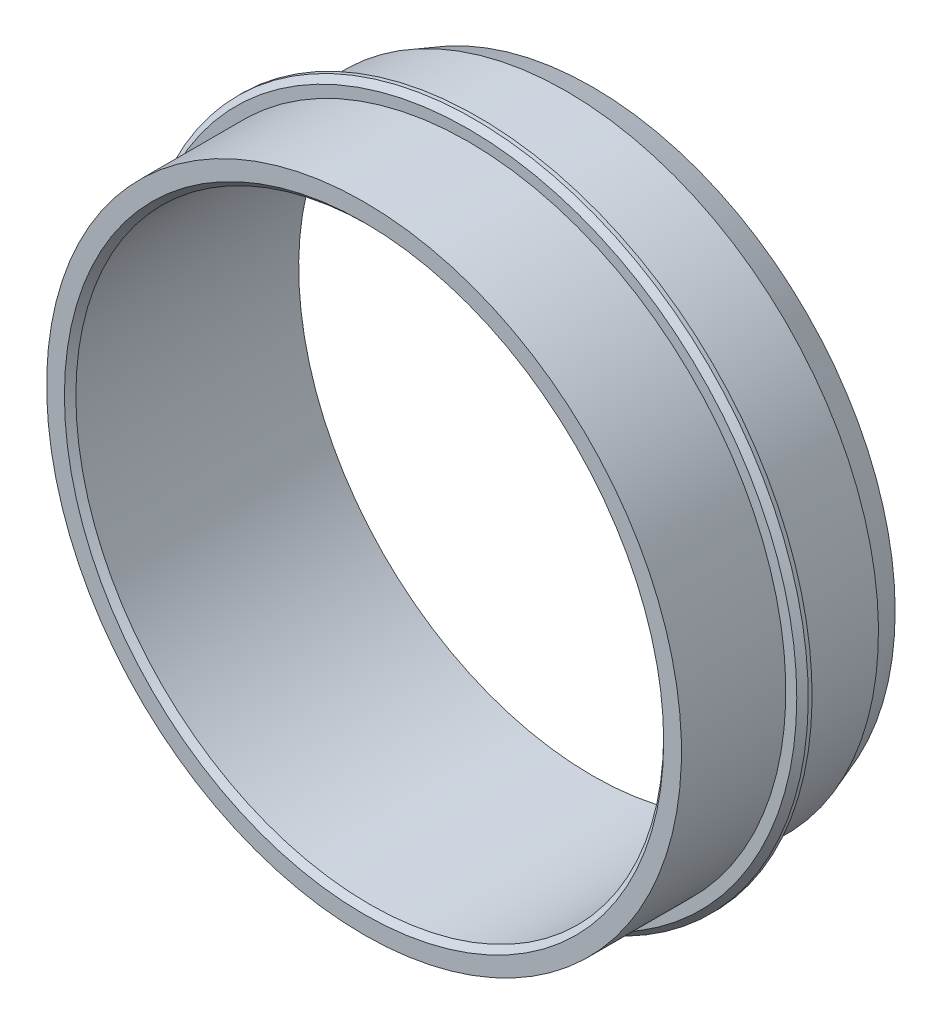
ISO-10303-21;
HEADER;
FILE_DESCRIPTION(('STEP AP214'),'2;1');
FILE_NAME('part.step','',(''),(''),'','','');
FILE_SCHEMA(('AUTOMOTIVE_DESIGN { 1 0 10303 214 1 1 1 1 }'));
ENDSEC;
DATA;
#1=APPLICATION_CONTEXT('core data for automotive mechanical design processes');
#2=APPLICATION_PROTOCOL_DEFINITION('international standard','automotive_design',2000,#1);
#3=PRODUCT_CONTEXT('',#1,'mechanical');
#4=PRODUCT('Part','Part','',(#3));
#5=PRODUCT_RELATED_PRODUCT_CATEGORY('part','',(#4));
#6=PRODUCT_DEFINITION_FORMATION('','',#4);
#7=PRODUCT_DEFINITION_CONTEXT('part definition',#1,'design');
#8=PRODUCT_DEFINITION('design','',#6,#7);
#9=PRODUCT_DEFINITION_SHAPE('','',#8);
#10=(LENGTH_UNIT() NAMED_UNIT(*) SI_UNIT(.MILLI.,.METRE.));
#11=(NAMED_UNIT(*) PLANE_ANGLE_UNIT() SI_UNIT($,.RADIAN.));
#12=(NAMED_UNIT(*) SI_UNIT($,.STERADIAN.) SOLID_ANGLE_UNIT());
#13=UNCERTAINTY_MEASURE_WITH_UNIT(LENGTH_MEASURE(1.E-05),#10,'distance_accuracy_value','');
#14=(GEOMETRIC_REPRESENTATION_CONTEXT(3) GLOBAL_UNCERTAINTY_ASSIGNED_CONTEXT((#13)) GLOBAL_UNIT_ASSIGNED_CONTEXT((#10,
#11,#12)) REPRESENTATION_CONTEXT('',''));
#15=CARTESIAN_POINT('',(0.,0.,0.));
#16=DIRECTION('',(0.,0.,1.));
#17=DIRECTION('',(1.,0.,0.));
#18=AXIS2_PLACEMENT_3D('',#15,#16,#17);
#19=CARTESIAN_POINT('',(-34.98,-24.5,900.55));
#20=DIRECTION('',(0.,0.,1.));
#21=DIRECTION('',(0.,-1.,0.));
#22=AXIS2_PLACEMENT_3D('',#19,#20,#21);
#23=PLANE('',#22);
#24=CARTESIAN_POINT('',(0.,-24.5,900.55));
#25=DIRECTION('',(0.,0.,-1.));
#26=DIRECTION('',(0.,-1.,0.));
#27=AXIS2_PLACEMENT_3D('',#24,#25,#26);
#28=CIRCLE('',#27,33.23);
#29=CARTESIAN_POINT('',(0.,-57.73,900.55));
#30=VERTEX_POINT('',#29);
#31=EDGE_CURVE('E104',#30,#30,#28,.T.);
#32=ORIENTED_EDGE('',*,*,#31,.T.);
#33=EDGE_LOOP('',(#32));
#34=FACE_BOUND('',#33,.T.);
#35=CARTESIAN_POINT('',(0.,-24.5,900.55));
#36=DIRECTION('',(0.,0.,1.));
#37=DIRECTION('',(0.,1.,0.));
#38=AXIS2_PLACEMENT_3D('',#35,#36,#37);
#39=CIRCLE('',#38,34.38);
#40=CARTESIAN_POINT('',(0.,-58.88,900.55));
#41=VERTEX_POINT('',#40);
#42=EDGE_CURVE('E73',#41,#41,#39,.T.);
#43=ORIENTED_EDGE('',*,*,#42,.T.);
#44=EDGE_LOOP('',(#43));
#45=FACE_BOUND('',#44,.T.);
#46=ADVANCED_FACE('F17',(#34,#45),#23,.T.);
#47=CARTESIAN_POINT('',(-32.68,-24.5,899.55));
#48=DIRECTION('',(0.,0.,-1.));
#49=DIRECTION('',(1.,0.,0.));
#50=AXIS2_PLACEMENT_3D('',#47,#48,#49);
#51=PLANE('',#50);
#52=CARTESIAN_POINT('',(0.,-24.5,899.55));
#53=DIRECTION('',(0.,0.,-1.));
#54=DIRECTION('',(0.,-1.,0.));
#55=AXIS2_PLACEMENT_3D('',#52,#53,#54);
#56=CIRCLE('',#55,32.68);
#57=CARTESIAN_POINT('',(0.,8.18,899.55));
#58=VERTEX_POINT('',#57);
#59=EDGE_CURVE('E28',#58,#58,#56,.T.);
#60=ORIENTED_EDGE('',*,*,#59,.F.);
#61=EDGE_LOOP('',(#60));
#62=FACE_BOUND('',#61,.T.);
#63=CARTESIAN_POINT('',(0.,-24.5,899.55));
#64=DIRECTION('',(0.,0.,-1.));
#65=DIRECTION('',(0.,-1.,0.));
#66=AXIS2_PLACEMENT_3D('',#63,#64,#65);
#67=CIRCLE('',#66,34.98);
#68=CARTESIAN_POINT('',(0.,-59.48,899.55));
#69=VERTEX_POINT('',#68);
#70=EDGE_CURVE('E119',#69,#69,#67,.T.);
#71=ORIENTED_EDGE('',*,*,#70,.T.);
#72=EDGE_LOOP('',(#71));
#73=FACE_BOUND('',#72,.T.);
#74=ADVANCED_FACE('F162',(#62,#73),#51,.T.);
#75=CARTESIAN_POINT('',(-30.77,-24.5,887.55));
#76=DIRECTION('',(0.,0.,-1.));
#77=DIRECTION('',(1.,0.,0.));
#78=AXIS2_PLACEMENT_3D('',#75,#76,#77);
#79=PLANE('',#78);
#80=CARTESIAN_POINT('',(0.,-24.5,887.55));
#81=DIRECTION('',(0.,0.,-1.));
#82=DIRECTION('',(0.,-1.,0.));
#83=AXIS2_PLACEMENT_3D('',#80,#81,#82);
#84=CIRCLE('',#83,30.77);
#85=CARTESIAN_POINT('',(0.,-55.27,887.55));
#86=VERTEX_POINT('',#85);
#87=EDGE_CURVE('E11',#86,#86,#84,.T.);
#88=ORIENTED_EDGE('',*,*,#87,.F.);
#89=EDGE_LOOP('',(#88));
#90=FACE_BOUND('',#89,.T.);
#91=CARTESIAN_POINT('',(0.,-24.5,887.55));
#92=DIRECTION('',(0.,0.,-1.));
#93=DIRECTION('',(0.,-1.,0.));
#94=AXIS2_PLACEMENT_3D('',#91,#92,#93);
#95=CIRCLE('',#94,31.68);
#96=CARTESIAN_POINT('',(0.,7.18,887.55));
#97=VERTEX_POINT('',#96);
#98=EDGE_CURVE('E98',#97,#97,#95,.T.);
#99=ORIENTED_EDGE('',*,*,#98,.T.);
#100=EDGE_LOOP('',(#99));
#101=FACE_BOUND('',#100,.T.);
#102=ADVANCED_FACE('F165',(#90,#101),#79,.T.);
#103=CARTESIAN_POINT('',(-33.23,-24.5,911.47505065));
#104=DIRECTION('',(0.,0.,1.));
#105=DIRECTION('',(0.,-1.,0.));
#106=AXIS2_PLACEMENT_3D('',#103,#104,#105);
#107=PLANE('',#106);
#108=CARTESIAN_POINT('',(0.,-24.5,911.47505065));
#109=DIRECTION('',(0.,0.,-1.));
#110=DIRECTION('',(0.,1.,0.));
#111=AXIS2_PLACEMENT_3D('',#108,#109,#110);
#112=CIRCLE('',#111,31.37);
#113=CARTESIAN_POINT('',(0.,6.87,911.47505065));
#114=VERTEX_POINT('',#113);
#115=EDGE_CURVE('E121',#114,#114,#112,.T.);
#116=ORIENTED_EDGE('',*,*,#115,.T.);
#117=EDGE_LOOP('',(#116));
#118=FACE_BOUND('',#117,.T.);
#119=CARTESIAN_POINT('',(0.,-24.5,911.47505065));
#120=DIRECTION('',(0.,0.,-1.));
#121=DIRECTION('',(0.,-1.,0.));
#122=AXIS2_PLACEMENT_3D('',#119,#120,#121);
#123=CIRCLE('',#122,33.23);
#124=CARTESIAN_POINT('',(0.,8.73,911.47505065));
#125=VERTEX_POINT('',#124);
#126=EDGE_CURVE('E88',#125,#125,#123,.T.);
#127=ORIENTED_EDGE('',*,*,#126,.F.);
#128=EDGE_LOOP('',(#127));
#129=FACE_BOUND('',#128,.T.);
#130=ADVANCED_FACE('F194',(#118,#129),#107,.T.);
#131=CARTESIAN_POINT('',(0.,-24.5,911.47505065));
#132=DIRECTION('',(0.,0.,-1.));
#133=DIRECTION('',(0.,-1.,0.));
#134=AXIS2_PLACEMENT_3D('',#131,#132,#133);
#135=CYLINDRICAL_SURFACE('',#134,30.77);
#136=ORIENTED_EDGE('',*,*,#87,.T.);
#137=EDGE_LOOP('',(#136));
#138=FACE_BOUND('',#137,.T.);
#139=CARTESIAN_POINT('',(0.,-24.5,910.87505065));
#140=DIRECTION('',(0.,0.,1.));
#141=DIRECTION('',(0.,1.,0.));
#142=AXIS2_PLACEMENT_3D('',#139,#140,#141);
#143=CIRCLE('',#142,30.77);
#144=CARTESIAN_POINT('',(0.,6.27,910.87505065));
#145=VERTEX_POINT('',#144);
#146=EDGE_CURVE('E123',#145,#145,#143,.T.);
#147=ORIENTED_EDGE('',*,*,#146,.T.);
#148=EDGE_LOOP('',(#147));
#149=FACE_BOUND('',#148,.T.);
#150=ADVANCED_FACE('F181',(#138,#149),#135,.F.);
#151=CARTESIAN_POINT('',(0.,-24.5,911.47505065));
#152=DIRECTION('',(0.,0.,-1.));
#153=DIRECTION('',(0.,-1.,0.));
#154=AXIS2_PLACEMENT_3D('',#151,#152,#153);
#155=CYLINDRICAL_SURFACE('',#154,32.68);
#156=CARTESIAN_POINT('',(0.,-24.5,890.297477419455));
#157=DIRECTION('',(0.,0.,1.));
#158=DIRECTION('',(0.,-1.,0.));
#159=AXIS2_PLACEMENT_3D('',#156,#157,#158);
#160=CIRCLE('',#159,32.68);
#161=CARTESIAN_POINT('',(0.,8.18,890.297477419455));
#162=VERTEX_POINT('',#161);
#163=EDGE_CURVE('E21',#162,#162,#160,.T.);
#164=ORIENTED_EDGE('',*,*,#163,.T.);
#165=EDGE_LOOP('',(#164));
#166=FACE_BOUND('',#165,.T.);
#167=ORIENTED_EDGE('',*,*,#59,.T.);
#168=EDGE_LOOP('',(#167));
#169=FACE_BOUND('',#168,.T.);
#170=ADVANCED_FACE('F19',(#166,#169),#155,.T.);
#171=CARTESIAN_POINT('',(0.,-24.5,911.47505065));
#172=DIRECTION('',(0.,0.,-1.));
#173=DIRECTION('',(0.,-1.,0.));
#174=AXIS2_PLACEMENT_3D('',#171,#172,#173);
#175=CYLINDRICAL_SURFACE('',#174,34.98);
#176=ORIENTED_EDGE('',*,*,#70,.F.);
#177=EDGE_LOOP('',(#176));
#178=FACE_BOUND('',#177,.T.);
#179=CARTESIAN_POINT('',(0.,-24.5,899.95));
#180=DIRECTION('',(0.,0.,-1.));
#181=DIRECTION('',(0.,1.,0.));
#182=AXIS2_PLACEMENT_3D('',#179,#180,#181);
#183=CIRCLE('',#182,34.98);
#184=CARTESIAN_POINT('',(0.,-59.48,899.95));
#185=VERTEX_POINT('',#184);
#186=EDGE_CURVE('E64',#185,#185,#183,.T.);
#187=ORIENTED_EDGE('',*,*,#186,.T.);
#188=EDGE_LOOP('',(#187));
#189=FACE_BOUND('',#188,.T.);
#190=ADVANCED_FACE('F169',(#178,#189),#175,.T.);
#191=CARTESIAN_POINT('',(0.,-24.5,911.47505065));
#192=DIRECTION('',(0.,0.,-1.));
#193=DIRECTION('',(0.,-1.,0.));
#194=AXIS2_PLACEMENT_3D('',#191,#192,#193);
#195=CYLINDRICAL_SURFACE('',#194,33.23);
#196=ORIENTED_EDGE('',*,*,#31,.F.);
#197=EDGE_LOOP('',(#196));
#198=FACE_BOUND('',#197,.T.);
#199=ORIENTED_EDGE('',*,*,#126,.T.);
#200=EDGE_LOOP('',(#199));
#201=FACE_BOUND('',#200,.T.);
#202=ADVANCED_FACE('F171',(#198,#201),#195,.T.);
#203=CARTESIAN_POINT('',(0.,-24.5,887.55));
#204=DIRECTION('',(0.,0.,1.));
#205=DIRECTION('',(0.,1.,0.));
#206=AXIS2_PLACEMENT_3D('',#203,#204,#205);
#207=CONICAL_SURFACE('',#206,31.68,0.349065850398865);
#208=ORIENTED_EDGE('',*,*,#163,.F.);
#209=EDGE_LOOP('',(#208));
#210=FACE_BOUND('',#209,.T.);
#211=ORIENTED_EDGE('',*,*,#98,.F.);
#212=EDGE_LOOP('',(#211));
#213=FACE_BOUND('',#212,.T.);
#214=ADVANCED_FACE('F178',(#210,#213),#207,.T.);
#215=CARTESIAN_POINT('',(0.,-24.5,899.95));
#216=DIRECTION('',(0.,0.,-1.));
#217=DIRECTION('',(0.,-1.,0.));
#218=AXIS2_PLACEMENT_3D('',#215,#216,#217);
#219=CONICAL_SURFACE('',#218,34.98,0.785398163397442);
#220=ORIENTED_EDGE('',*,*,#186,.F.);
#221=EDGE_LOOP('',(#220));
#222=FACE_BOUND('',#221,.T.);
#223=ORIENTED_EDGE('',*,*,#42,.F.);
#224=EDGE_LOOP('',(#223));
#225=FACE_BOUND('',#224,.T.);
#226=ADVANCED_FACE('F192',(#222,#225),#219,.T.);
#227=CARTESIAN_POINT('',(0.,-24.5,911.47505065));
#228=DIRECTION('',(0.,0.,1.));
#229=DIRECTION('',(0.,1.,0.));
#230=AXIS2_PLACEMENT_3D('',#227,#228,#229);
#231=CONICAL_SURFACE('',#230,31.37,0.785398163397451);
#232=ORIENTED_EDGE('',*,*,#115,.F.);
#233=EDGE_LOOP('',(#232));
#234=FACE_BOUND('',#233,.T.);
#235=ORIENTED_EDGE('',*,*,#146,.F.);
#236=EDGE_LOOP('',(#235));
#237=FACE_BOUND('',#236,.T.);
#238=ADVANCED_FACE('F205',(#234,#237),#231,.F.);
#239=CLOSED_SHELL('',(#46,#74,#102,#130,#150,#170,#190,#202,#214,#226,#238));
#240=MANIFOLD_SOLID_BREP('B1',#239);
#241=ADVANCED_BREP_SHAPE_REPRESENTATION('',(#18,#240),#14);
#242=SHAPE_DEFINITION_REPRESENTATION(#9,#241);
ENDSEC;
END-ISO-10303-21;
